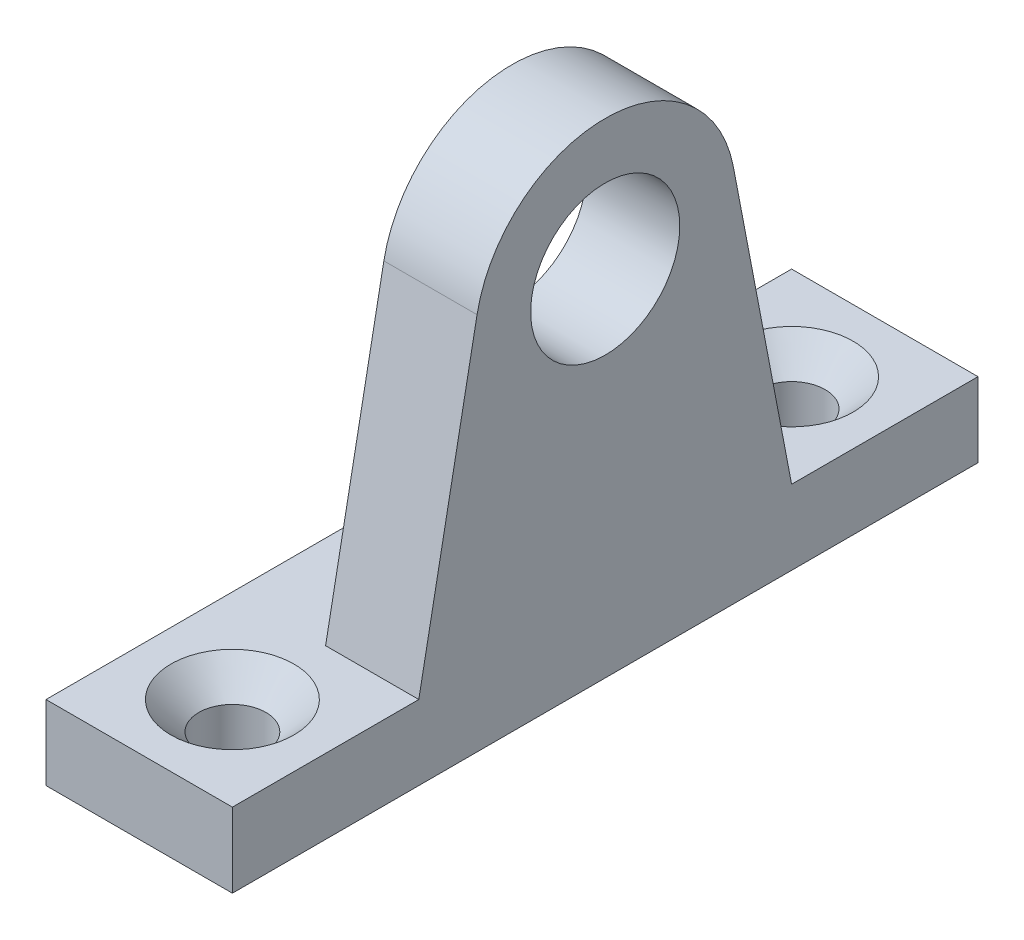
ISO-10303-21;
HEADER;
FILE_DESCRIPTION(('STEP AP214'),'2;1');
FILE_NAME('part.step','',(''),(''),'','','');
FILE_SCHEMA(('AUTOMOTIVE_DESIGN { 1 0 10303 214 1 1 1 1 }'));
ENDSEC;
DATA;
#1=APPLICATION_CONTEXT('core data for automotive mechanical design processes');
#2=APPLICATION_PROTOCOL_DEFINITION('international standard','automotive_design',2000,#1);
#3=PRODUCT_CONTEXT('',#1,'mechanical');
#4=PRODUCT('Part','Part','',(#3));
#5=PRODUCT_RELATED_PRODUCT_CATEGORY('part','',(#4));
#6=PRODUCT_DEFINITION_FORMATION('','',#4);
#7=PRODUCT_DEFINITION_CONTEXT('part definition',#1,'design');
#8=PRODUCT_DEFINITION('design','',#6,#7);
#9=PRODUCT_DEFINITION_SHAPE('','',#8);
#10=(LENGTH_UNIT() NAMED_UNIT(*) SI_UNIT(.MILLI.,.METRE.));
#11=(NAMED_UNIT(*) PLANE_ANGLE_UNIT() SI_UNIT($,.RADIAN.));
#12=(NAMED_UNIT(*) SI_UNIT($,.STERADIAN.) SOLID_ANGLE_UNIT());
#13=UNCERTAINTY_MEASURE_WITH_UNIT(LENGTH_MEASURE(1.E-05),#10,'distance_accuracy_value','');
#14=(GEOMETRIC_REPRESENTATION_CONTEXT(3) GLOBAL_UNCERTAINTY_ASSIGNED_CONTEXT((#13)) GLOBAL_UNIT_ASSIGNED_CONTEXT((#10,
#11,#12)) REPRESENTATION_CONTEXT('',''));
#15=CARTESIAN_POINT('',(0.,0.,0.));
#16=DIRECTION('',(0.,0.,1.));
#17=DIRECTION('',(1.,0.,0.));
#18=AXIS2_PLACEMENT_3D('',#15,#16,#17);
#19=CARTESIAN_POINT('',(0.,19.,0.));
#20=DIRECTION('',(1.,0.,0.));
#21=DIRECTION('',(0.,0.,-1.));
#22=AXIS2_PLACEMENT_3D('',#19,#20,#21);
#23=PLANE('',#22);
#24=CARTESIAN_POINT('',(0.,19.,0.));
#25=DIRECTION('',(1.,0.,0.));
#26=DIRECTION('',(0.,0.,-1.));
#27=AXIS2_PLACEMENT_3D('',#24,#25,#26);
#28=CIRCLE('',#27,4.);
#29=CARTESIAN_POINT('',(0.,19.,-4.));
#30=VERTEX_POINT('',#29);
#31=EDGE_CURVE('E182',#30,#30,#28,.T.);
#32=ORIENTED_EDGE('',*,*,#31,.T.);
#33=EDGE_LOOP('',(#32));
#34=FACE_BOUND('',#33,.T.);
#35=DIRECTION('',(0.,0.,-1.));
#36=VECTOR('',#35,1.);
#37=CARTESIAN_POINT('',(0.,4.,-20.));
#38=LINE('',#37,#36);
#39=CARTESIAN_POINT('',(0.,4.00000000000001,10.));
#40=VERTEX_POINT('',#39);
#41=CARTESIAN_POINT('',(0.,4.,-10.));
#42=VERTEX_POINT('',#41);
#43=EDGE_CURVE('E11',#40,#42,#38,.T.);
#44=ORIENTED_EDGE('',*,*,#43,.F.);
#45=DIRECTION('',(0.,-0.982149895038592,0.188099930025728));
#46=VECTOR('',#45,1.);
#47=CARTESIAN_POINT('',(0.,20.3166995101801,6.87504926527014));
#48=LINE('',#47,#46);
#49=CARTESIAN_POINT('',(0.,20.3166995101801,6.87504926527014));
#50=VERTEX_POINT('',#49);
#51=EDGE_CURVE('E127',#50,#40,#48,.T.);
#52=ORIENTED_EDGE('',*,*,#51,.F.);
#53=CARTESIAN_POINT('',(0.,19.,0.));
#54=DIRECTION('',(1.,0.,0.));
#55=DIRECTION('',(0.,0.,-1.));
#56=AXIS2_PLACEMENT_3D('',#53,#54,#55);
#57=CIRCLE('',#56,7.);
#58=CARTESIAN_POINT('',(0.,20.3166995101801,-6.87504926527014));
#59=VERTEX_POINT('',#58);
#60=EDGE_CURVE('E124',#59,#50,#57,.T.);
#61=ORIENTED_EDGE('',*,*,#60,.F.);
#62=DIRECTION('',(0.,0.982149895038592,0.188099930025728));
#63=VECTOR('',#62,1.);
#64=CARTESIAN_POINT('',(0.,4.,-10.));
#65=LINE('',#64,#63);
#66=EDGE_CURVE('E70',#42,#59,#65,.T.);
#67=ORIENTED_EDGE('',*,*,#66,.F.);
#68=EDGE_LOOP('',(#44,#52,#61,#67));
#69=FACE_BOUND('',#68,.T.);
#70=ADVANCED_FACE('F33',(#34,#69),#23,.F.);
#71=CARTESIAN_POINT('',(5.,19.,0.));
#72=DIRECTION('',(1.,0.,0.));
#73=DIRECTION('',(0.,0.,-1.));
#74=AXIS2_PLACEMENT_3D('',#71,#72,#73);
#75=PLANE('',#74);
#76=CARTESIAN_POINT('',(5.,19.,0.));
#77=DIRECTION('',(1.,0.,0.));
#78=DIRECTION('',(0.,0.,-1.));
#79=AXIS2_PLACEMENT_3D('',#76,#77,#78);
#80=CIRCLE('',#79,7.);
#81=CARTESIAN_POINT('',(5.,20.3166995101801,-6.87504926527014));
#82=VERTEX_POINT('',#81);
#83=CARTESIAN_POINT('',(5.,20.3166995101801,6.87504926527014));
#84=VERTEX_POINT('',#83);
#85=EDGE_CURVE('E132',#82,#84,#80,.T.);
#86=ORIENTED_EDGE('',*,*,#85,.T.);
#87=DIRECTION('',(0.,-0.982149895038592,0.188099930025728));
#88=VECTOR('',#87,1.);
#89=CARTESIAN_POINT('',(5.,20.3166995101801,6.87504926527014));
#90=LINE('',#89,#88);
#91=CARTESIAN_POINT('',(5.,4.,10.));
#92=VERTEX_POINT('',#91);
#93=EDGE_CURVE('E79',#84,#92,#90,.T.);
#94=ORIENTED_EDGE('',*,*,#93,.T.);
#95=DIRECTION('',(0.,0.,1.));
#96=VECTOR('',#95,1.);
#97=CARTESIAN_POINT('',(5.,4.,10.));
#98=LINE('',#97,#96);
#99=CARTESIAN_POINT('',(5.,4.,20.));
#100=VERTEX_POINT('',#99);
#101=EDGE_CURVE('E187',#92,#100,#98,.T.);
#102=ORIENTED_EDGE('',*,*,#101,.T.);
#103=DIRECTION('',(0.,-1.,0.));
#104=VECTOR('',#103,1.);
#105=CARTESIAN_POINT('',(5.,4.,20.));
#106=LINE('',#105,#104);
#107=CARTESIAN_POINT('',(5.,0.,20.));
#108=VERTEX_POINT('',#107);
#109=EDGE_CURVE('E166',#100,#108,#106,.T.);
#110=ORIENTED_EDGE('',*,*,#109,.T.);
#111=DIRECTION('',(0.,0.,-1.));
#112=VECTOR('',#111,1.);
#113=CARTESIAN_POINT('',(5.,0.,20.));
#114=LINE('',#113,#112);
#115=CARTESIAN_POINT('',(5.,0.,-20.));
#116=VERTEX_POINT('',#115);
#117=EDGE_CURVE('E101',#108,#116,#114,.T.);
#118=ORIENTED_EDGE('',*,*,#117,.T.);
#119=DIRECTION('',(0.,1.,0.));
#120=VECTOR('',#119,1.);
#121=CARTESIAN_POINT('',(5.,0.,-20.));
#122=LINE('',#121,#120);
#123=CARTESIAN_POINT('',(5.,4.,-20.));
#124=VERTEX_POINT('',#123);
#125=EDGE_CURVE('E94',#116,#124,#122,.T.);
#126=ORIENTED_EDGE('',*,*,#125,.T.);
#127=DIRECTION('',(0.,0.,1.));
#128=VECTOR('',#127,1.);
#129=CARTESIAN_POINT('',(5.,4.,-20.));
#130=LINE('',#129,#128);
#131=CARTESIAN_POINT('',(5.,4.,-10.));
#132=VERTEX_POINT('',#131);
#133=EDGE_CURVE('E99',#124,#132,#130,.T.);
#134=ORIENTED_EDGE('',*,*,#133,.T.);
#135=DIRECTION('',(0.,0.982149895038592,0.188099930025728));
#136=VECTOR('',#135,1.);
#137=CARTESIAN_POINT('',(5.,4.,-10.));
#138=LINE('',#137,#136);
#139=EDGE_CURVE('E51',#132,#82,#138,.T.);
#140=ORIENTED_EDGE('',*,*,#139,.T.);
#141=EDGE_LOOP('',(#86,#94,#102,#110,#118,#126,#134,#140));
#142=FACE_BOUND('',#141,.T.);
#143=CARTESIAN_POINT('',(5.,19.,0.));
#144=DIRECTION('',(1.,0.,0.));
#145=DIRECTION('',(0.,0.,-1.));
#146=AXIS2_PLACEMENT_3D('',#143,#144,#145);
#147=CIRCLE('',#146,4.);
#148=CARTESIAN_POINT('',(5.,19.,-4.));
#149=VERTEX_POINT('',#148);
#150=EDGE_CURVE('E128',#149,#149,#147,.T.);
#151=ORIENTED_EDGE('',*,*,#150,.F.);
#152=EDGE_LOOP('',(#151));
#153=FACE_BOUND('',#152,.T.);
#154=ADVANCED_FACE('F96',(#142,#153),#75,.T.);
#155=CARTESIAN_POINT('',(5.,19.,0.));
#156=DIRECTION('',(-1.,0.,0.));
#157=DIRECTION('',(0.,0.,1.));
#158=AXIS2_PLACEMENT_3D('',#155,#156,#157);
#159=CYLINDRICAL_SURFACE('',#158,7.);
#160=ORIENTED_EDGE('',*,*,#60,.T.);
#161=DIRECTION('',(-1.,0.,0.));
#162=VECTOR('',#161,1.);
#163=CARTESIAN_POINT('',(5.,20.3166995101801,6.87504926527014));
#164=LINE('',#163,#162);
#165=EDGE_CURVE('E37',#84,#50,#164,.T.);
#166=ORIENTED_EDGE('',*,*,#165,.F.);
#167=ORIENTED_EDGE('',*,*,#85,.F.);
#168=DIRECTION('',(-1.,0.,0.));
#169=VECTOR('',#168,1.);
#170=CARTESIAN_POINT('',(5.,20.3166995101801,-6.87504926527014));
#171=LINE('',#170,#169);
#172=EDGE_CURVE('E120',#82,#59,#171,.T.);
#173=ORIENTED_EDGE('',*,*,#172,.T.);
#174=EDGE_LOOP('',(#160,#166,#167,#173));
#175=FACE_BOUND('',#174,.T.);
#176=ADVANCED_FACE('F35',(#175),#159,.T.);
#177=CARTESIAN_POINT('',(5.,20.3166995101801,6.87504926527014));
#178=DIRECTION('',(0.,-0.188099930025728,-0.982149895038592));
#179=DIRECTION('',(0.,0.982149895038592,-0.188099930025728));
#180=AXIS2_PLACEMENT_3D('',#177,#178,#179);
#181=PLANE('',#180);
#182=ORIENTED_EDGE('',*,*,#51,.T.);
#183=DIRECTION('',(-1.,0.,0.));
#184=VECTOR('',#183,1.);
#185=CARTESIAN_POINT('',(5.,4.,10.));
#186=LINE('',#185,#184);
#187=EDGE_CURVE('E141',#92,#40,#186,.T.);
#188=ORIENTED_EDGE('',*,*,#187,.F.);
#189=ORIENTED_EDGE('',*,*,#93,.F.);
#190=ORIENTED_EDGE('',*,*,#165,.T.);
#191=EDGE_LOOP('',(#182,#188,#189,#190));
#192=FACE_BOUND('',#191,.T.);
#193=ADVANCED_FACE('F144',(#192),#181,.F.);
#194=CARTESIAN_POINT('',(5.,4.,20.));
#195=DIRECTION('',(0.,0.,-1.));
#196=DIRECTION('',(-1.,0.,0.));
#197=AXIS2_PLACEMENT_3D('',#194,#195,#196);
#198=PLANE('',#197);
#199=DIRECTION('',(-1.,0.,0.));
#200=VECTOR('',#199,1.);
#201=CARTESIAN_POINT('',(5.,4.,20.));
#202=LINE('',#201,#200);
#203=CARTESIAN_POINT('',(-4.99999999999999,4.00000000000001,20.));
#204=VERTEX_POINT('',#203);
#205=EDGE_CURVE('E139',#100,#204,#202,.T.);
#206=ORIENTED_EDGE('',*,*,#205,.T.);
#207=DIRECTION('',(0.,1.,0.));
#208=VECTOR('',#207,1.);
#209=CARTESIAN_POINT('',(-4.99999999999999,-40.3112887414928,20.));
#210=LINE('',#209,#208);
#211=CARTESIAN_POINT('',(-4.99999999999999,0.,20.));
#212=VERTEX_POINT('',#211);
#213=EDGE_CURVE('E165',#212,#204,#210,.T.);
#214=ORIENTED_EDGE('',*,*,#213,.F.);
#215=DIRECTION('',(-1.,0.,0.));
#216=VECTOR('',#215,1.);
#217=CARTESIAN_POINT('',(5.,0.,20.));
#218=LINE('',#217,#216);
#219=EDGE_CURVE('E136',#108,#212,#218,.T.);
#220=ORIENTED_EDGE('',*,*,#219,.F.);
#221=ORIENTED_EDGE('',*,*,#109,.F.);
#222=EDGE_LOOP('',(#206,#214,#220,#221));
#223=FACE_BOUND('',#222,.T.);
#224=ADVANCED_FACE('F164',(#223),#198,.F.);
#225=CARTESIAN_POINT('',(5.,0.,20.));
#226=DIRECTION('',(0.,1.,0.));
#227=DIRECTION('',(0.,0.,1.));
#228=AXIS2_PLACEMENT_3D('',#225,#226,#227);
#229=PLANE('',#228);
#230=CARTESIAN_POINT('',(0.,0.,-15.));
#231=DIRECTION('',(0.,1.,0.));
#232=DIRECTION('',(0.,0.,1.));
#233=AXIS2_PLACEMENT_3D('',#230,#231,#232);
#234=CIRCLE('',#233,1.8);
#235=CARTESIAN_POINT('',(0.,0.,-13.2));
#236=VERTEX_POINT('',#235);
#237=EDGE_CURVE('E196',#236,#236,#234,.T.);
#238=ORIENTED_EDGE('',*,*,#237,.T.);
#239=EDGE_LOOP('',(#238));
#240=FACE_BOUND('',#239,.T.);
#241=CARTESIAN_POINT('',(0.,0.,15.));
#242=DIRECTION('',(0.,1.,0.));
#243=DIRECTION('',(0.,0.,1.));
#244=AXIS2_PLACEMENT_3D('',#241,#242,#243);
#245=CIRCLE('',#244,1.8);
#246=CARTESIAN_POINT('',(0.,0.,16.8));
#247=VERTEX_POINT('',#246);
#248=EDGE_CURVE('E172',#247,#247,#245,.T.);
#249=ORIENTED_EDGE('',*,*,#248,.T.);
#250=EDGE_LOOP('',(#249));
#251=FACE_BOUND('',#250,.T.);
#252=ORIENTED_EDGE('',*,*,#219,.T.);
#253=DIRECTION('',(0.,0.,-1.));
#254=VECTOR('',#253,1.);
#255=CARTESIAN_POINT('',(-5.,0.,-20.));
#256=LINE('',#255,#254);
#257=CARTESIAN_POINT('',(-5.,0.,-20.));
#258=VERTEX_POINT('',#257);
#259=EDGE_CURVE('E170',#212,#258,#256,.T.);
#260=ORIENTED_EDGE('',*,*,#259,.T.);
#261=DIRECTION('',(-1.,0.,0.));
#262=VECTOR('',#261,1.);
#263=CARTESIAN_POINT('',(5.,0.,-20.));
#264=LINE('',#263,#262);
#265=EDGE_CURVE('E115',#116,#258,#264,.T.);
#266=ORIENTED_EDGE('',*,*,#265,.F.);
#267=ORIENTED_EDGE('',*,*,#117,.F.);
#268=EDGE_LOOP('',(#252,#260,#266,#267));
#269=FACE_BOUND('',#268,.T.);
#270=ADVANCED_FACE('F189',(#240,#251,#269),#229,.F.);
#271=CARTESIAN_POINT('',(5.,0.,-20.));
#272=DIRECTION('',(0.,0.,1.));
#273=DIRECTION('',(1.,0.,0.));
#274=AXIS2_PLACEMENT_3D('',#271,#272,#273);
#275=PLANE('',#274);
#276=ORIENTED_EDGE('',*,*,#265,.T.);
#277=DIRECTION('',(0.,1.,0.));
#278=VECTOR('',#277,1.);
#279=CARTESIAN_POINT('',(-5.,-40.3112887414928,-20.));
#280=LINE('',#279,#278);
#281=CARTESIAN_POINT('',(-5.,4.,-20.));
#282=VERTEX_POINT('',#281);
#283=EDGE_CURVE('E112',#258,#282,#280,.T.);
#284=ORIENTED_EDGE('',*,*,#283,.T.);
#285=DIRECTION('',(-1.,0.,0.));
#286=VECTOR('',#285,1.);
#287=CARTESIAN_POINT('',(5.,4.,-20.));
#288=LINE('',#287,#286);
#289=EDGE_CURVE('E108',#124,#282,#288,.T.);
#290=ORIENTED_EDGE('',*,*,#289,.F.);
#291=ORIENTED_EDGE('',*,*,#125,.F.);
#292=EDGE_LOOP('',(#276,#284,#290,#291));
#293=FACE_BOUND('',#292,.T.);
#294=ADVANCED_FACE('F109',(#293),#275,.F.);
#295=CARTESIAN_POINT('',(5.,4.,-20.));
#296=DIRECTION('',(0.,-1.,0.));
#297=DIRECTION('',(0.,0.,-1.));
#298=AXIS2_PLACEMENT_3D('',#295,#296,#297);
#299=PLANE('',#298);
#300=CARTESIAN_POINT('',(0.,4.,-15.));
#301=DIRECTION('',(0.,1.,0.));
#302=DIRECTION('',(0.,0.,1.));
#303=AXIS2_PLACEMENT_3D('',#300,#301,#302);
#304=CIRCLE('',#303,3.3);
#305=CARTESIAN_POINT('',(0.,4.,-11.7));
#306=VERTEX_POINT('',#305);
#307=EDGE_CURVE('E202',#306,#306,#304,.T.);
#308=ORIENTED_EDGE('',*,*,#307,.F.);
#309=EDGE_LOOP('',(#308));
#310=FACE_BOUND('',#309,.T.);
#311=CARTESIAN_POINT('',(0.,4.00000000000001,15.));
#312=DIRECTION('',(0.,1.,0.));
#313=DIRECTION('',(0.,0.,1.));
#314=AXIS2_PLACEMENT_3D('',#311,#312,#313);
#315=CIRCLE('',#314,3.3);
#316=CARTESIAN_POINT('',(0.,4.00000000000001,18.3));
#317=VERTEX_POINT('',#316);
#318=EDGE_CURVE('E193',#317,#317,#315,.T.);
#319=ORIENTED_EDGE('',*,*,#318,.F.);
#320=EDGE_LOOP('',(#319));
#321=FACE_BOUND('',#320,.T.);
#322=ORIENTED_EDGE('',*,*,#289,.T.);
#323=DIRECTION('',(0.,0.,1.));
#324=VECTOR('',#323,1.);
#325=CARTESIAN_POINT('',(-5.,4.,-20.));
#326=LINE('',#325,#324);
#327=EDGE_CURVE('E169',#282,#204,#326,.T.);
#328=ORIENTED_EDGE('',*,*,#327,.T.);
#329=ORIENTED_EDGE('',*,*,#205,.F.);
#330=ORIENTED_EDGE('',*,*,#101,.F.);
#331=ORIENTED_EDGE('',*,*,#187,.T.);
#332=ORIENTED_EDGE('',*,*,#43,.T.);
#333=DIRECTION('',(-1.,0.,0.));
#334=VECTOR('',#333,1.);
#335=CARTESIAN_POINT('',(5.,4.,-10.));
#336=LINE('',#335,#334);
#337=EDGE_CURVE('E116',#132,#42,#336,.T.);
#338=ORIENTED_EDGE('',*,*,#337,.F.);
#339=ORIENTED_EDGE('',*,*,#133,.F.);
#340=EDGE_LOOP('',(#322,#328,#329,#330,#331,#332,#338,#339));
#341=FACE_BOUND('',#340,.T.);
#342=ADVANCED_FACE('F118',(#310,#321,#341),#299,.F.);
#343=CARTESIAN_POINT('',(5.,4.,-10.));
#344=DIRECTION('',(0.,-0.188099930025728,0.982149895038592));
#345=DIRECTION('',(0.,-0.982149895038592,-0.188099930025728));
#346=AXIS2_PLACEMENT_3D('',#343,#344,#345);
#347=PLANE('',#346);
#348=ORIENTED_EDGE('',*,*,#66,.T.);
#349=ORIENTED_EDGE('',*,*,#172,.F.);
#350=ORIENTED_EDGE('',*,*,#139,.F.);
#351=ORIENTED_EDGE('',*,*,#337,.T.);
#352=EDGE_LOOP('',(#348,#349,#350,#351));
#353=FACE_BOUND('',#352,.T.);
#354=ADVANCED_FACE('F210',(#353),#347,.F.);
#355=CARTESIAN_POINT('',(5.,19.,0.));
#356=DIRECTION('',(-1.,0.,0.));
#357=DIRECTION('',(0.,0.,1.));
#358=AXIS2_PLACEMENT_3D('',#355,#356,#357);
#359=CYLINDRICAL_SURFACE('',#358,4.);
#360=ORIENTED_EDGE('',*,*,#150,.T.);
#361=EDGE_LOOP('',(#360));
#362=FACE_BOUND('',#361,.T.);
#363=ORIENTED_EDGE('',*,*,#31,.F.);
#364=EDGE_LOOP('',(#363));
#365=FACE_BOUND('',#364,.T.);
#366=ADVANCED_FACE('F239',(#362,#365),#359,.F.);
#367=CARTESIAN_POINT('',(-5.,-40.3112887414928,-20.));
#368=DIRECTION('',(-1.,0.,0.));
#369=DIRECTION('',(0.,0.,1.));
#370=AXIS2_PLACEMENT_3D('',#367,#368,#369);
#371=PLANE('',#370);
#372=ORIENTED_EDGE('',*,*,#259,.F.);
#373=ORIENTED_EDGE('',*,*,#213,.T.);
#374=ORIENTED_EDGE('',*,*,#327,.F.);
#375=ORIENTED_EDGE('',*,*,#283,.F.);
#376=EDGE_LOOP('',(#372,#373,#374,#375));
#377=FACE_BOUND('',#376,.T.);
#378=ADVANCED_FACE('F168',(#377),#371,.T.);
#379=CARTESIAN_POINT('',(0.,4.00000000000001,15.));
#380=DIRECTION('',(0.,1.,0.));
#381=DIRECTION('',(0.,0.,1.));
#382=AXIS2_PLACEMENT_3D('',#379,#380,#381);
#383=CYLINDRICAL_SURFACE('',#382,1.8);
#384=ORIENTED_EDGE('',*,*,#248,.F.);
#385=EDGE_LOOP('',(#384));
#386=FACE_BOUND('',#385,.T.);
#387=CARTESIAN_POINT('',(0.,2.50000000000001,15.));
#388=DIRECTION('',(0.,1.,0.));
#389=DIRECTION('',(0.,0.,1.));
#390=AXIS2_PLACEMENT_3D('',#387,#388,#389);
#391=CIRCLE('',#390,1.8);
#392=CARTESIAN_POINT('',(0.,2.50000000000001,16.8));
#393=VERTEX_POINT('',#392);
#394=EDGE_CURVE('E176',#393,#393,#391,.T.);
#395=ORIENTED_EDGE('',*,*,#394,.T.);
#396=EDGE_LOOP('',(#395));
#397=FACE_BOUND('',#396,.T.);
#398=ADVANCED_FACE('F217',(#386,#397),#383,.F.);
#399=CARTESIAN_POINT('',(0.,4.00000000000001,15.));
#400=DIRECTION('',(0.,1.,0.));
#401=DIRECTION('',(0.,0.,1.));
#402=AXIS2_PLACEMENT_3D('',#399,#400,#401);
#403=CONICAL_SURFACE('',#402,3.3,0.785398163397448);
#404=ORIENTED_EDGE('',*,*,#394,.F.);
#405=EDGE_LOOP('',(#404));
#406=FACE_BOUND('',#405,.T.);
#407=ORIENTED_EDGE('',*,*,#318,.T.);
#408=EDGE_LOOP('',(#407));
#409=FACE_BOUND('',#408,.T.);
#410=ADVANCED_FACE('F214',(#406,#409),#403,.F.);
#411=CARTESIAN_POINT('',(0.,4.,-15.));
#412=DIRECTION('',(0.,1.,0.));
#413=DIRECTION('',(0.,0.,1.));
#414=AXIS2_PLACEMENT_3D('',#411,#412,#413);
#415=CYLINDRICAL_SURFACE('',#414,1.8);
#416=ORIENTED_EDGE('',*,*,#237,.F.);
#417=EDGE_LOOP('',(#416));
#418=FACE_BOUND('',#417,.T.);
#419=CARTESIAN_POINT('',(0.,2.5,-15.));
#420=DIRECTION('',(0.,1.,0.));
#421=DIRECTION('',(0.,0.,1.));
#422=AXIS2_PLACEMENT_3D('',#419,#420,#421);
#423=CIRCLE('',#422,1.8);
#424=CARTESIAN_POINT('',(0.,2.5,-13.2));
#425=VERTEX_POINT('',#424);
#426=EDGE_CURVE('E199',#425,#425,#423,.T.);
#427=ORIENTED_EDGE('',*,*,#426,.T.);
#428=EDGE_LOOP('',(#427));
#429=FACE_BOUND('',#428,.T.);
#430=ADVANCED_FACE('F216',(#418,#429),#415,.F.);
#431=CARTESIAN_POINT('',(0.,4.,-15.));
#432=DIRECTION('',(0.,1.,0.));
#433=DIRECTION('',(0.,0.,1.));
#434=AXIS2_PLACEMENT_3D('',#431,#432,#433);
#435=CONICAL_SURFACE('',#434,3.3,0.785398163397448);
#436=ORIENTED_EDGE('',*,*,#426,.F.);
#437=EDGE_LOOP('',(#436));
#438=FACE_BOUND('',#437,.T.);
#439=ORIENTED_EDGE('',*,*,#307,.T.);
#440=EDGE_LOOP('',(#439));
#441=FACE_BOUND('',#440,.T.);
#442=ADVANCED_FACE('F206',(#438,#441),#435,.F.);
#443=CLOSED_SHELL('',(#70,#154,#176,#193,#224,#270,#294,#342,#354,#366,#378,#398,#410,#430,#442));
#444=MANIFOLD_SOLID_BREP('B2',#443);
#445=ADVANCED_BREP_SHAPE_REPRESENTATION('',(#18,#444),#14);
#446=SHAPE_DEFINITION_REPRESENTATION(#9,#445);
ENDSEC;
END-ISO-10303-21;
